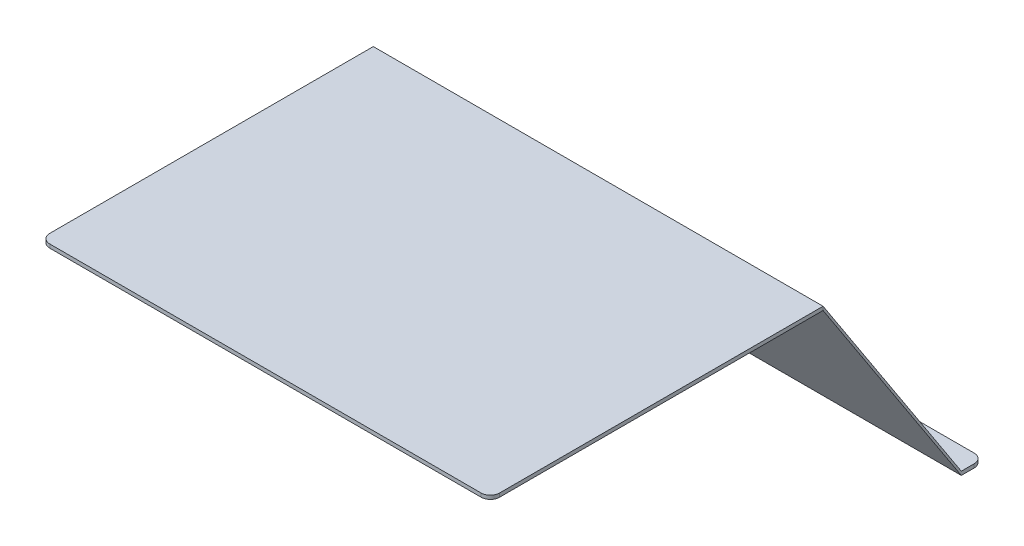
ISO-10303-21;
HEADER;
FILE_DESCRIPTION(('STEP AP214'),'2;1');
FILE_NAME('part.step','',(''),(''),'','','');
FILE_SCHEMA(('AUTOMOTIVE_DESIGN { 1 0 10303 214 1 1 1 1 }'));
ENDSEC;
DATA;
#1=APPLICATION_CONTEXT('core data for automotive mechanical design processes');
#2=APPLICATION_PROTOCOL_DEFINITION('international standard','automotive_design',2000,#1);
#3=PRODUCT_CONTEXT('',#1,'mechanical');
#4=PRODUCT('Part','Part','',(#3));
#5=PRODUCT_RELATED_PRODUCT_CATEGORY('part','',(#4));
#6=PRODUCT_DEFINITION_FORMATION('','',#4);
#7=PRODUCT_DEFINITION_CONTEXT('part definition',#1,'design');
#8=PRODUCT_DEFINITION('design','',#6,#7);
#9=PRODUCT_DEFINITION_SHAPE('','',#8);
#10=(LENGTH_UNIT() NAMED_UNIT(*) SI_UNIT(.MILLI.,.METRE.));
#11=(NAMED_UNIT(*) PLANE_ANGLE_UNIT() SI_UNIT($,.RADIAN.));
#12=(NAMED_UNIT(*) SI_UNIT($,.STERADIAN.) SOLID_ANGLE_UNIT());
#13=UNCERTAINTY_MEASURE_WITH_UNIT(LENGTH_MEASURE(1.E-05),#10,'distance_accuracy_value','');
#14=(GEOMETRIC_REPRESENTATION_CONTEXT(3) GLOBAL_UNCERTAINTY_ASSIGNED_CONTEXT((#13)) GLOBAL_UNIT_ASSIGNED_CONTEXT((#10,
#11,#12)) REPRESENTATION_CONTEXT('',''));
#15=CARTESIAN_POINT('',(0.,0.,0.));
#16=DIRECTION('',(0.,0.,1.));
#17=DIRECTION('',(1.,0.,0.));
#18=AXIS2_PLACEMENT_3D('',#15,#16,#17);
#19=CARTESIAN_POINT('',(0.,0.,-361.));
#20=DIRECTION('',(0.,0.,1.));
#21=DIRECTION('',(1.,0.,0.));
#22=AXIS2_PLACEMENT_3D('',#19,#20,#21);
#23=PLANE('',#22);
#24=DIRECTION('',(0.,-1.,0.));
#25=VECTOR('',#24,1.);
#26=CARTESIAN_POINT('',(488.,0.,-361.));
#27=LINE('',#26,#25);
#28=CARTESIAN_POINT('',(488.,4.,-361.));
#29=VERTEX_POINT('',#28);
#30=CARTESIAN_POINT('',(488.,0.,-361.));
#31=VERTEX_POINT('',#30);
#32=EDGE_CURVE('E172',#29,#31,#27,.T.);
#33=ORIENTED_EDGE('',*,*,#32,.F.);
#34=DIRECTION('',(1.,0.,0.));
#35=VECTOR('',#34,1.);
#36=CARTESIAN_POINT('',(0.,4.,-361.));
#37=LINE('',#36,#35);
#38=CARTESIAN_POINT('',(0.,4.,-361.));
#39=VERTEX_POINT('',#38);
#40=EDGE_CURVE('E123',#39,#29,#37,.T.);
#41=ORIENTED_EDGE('',*,*,#40,.F.);
#42=DIRECTION('',(0.,-1.,0.));
#43=VECTOR('',#42,1.);
#44=CARTESIAN_POINT('',(0.,0.,-361.));
#45=LINE('',#44,#43);
#46=CARTESIAN_POINT('',(0.,0.,-361.));
#47=VERTEX_POINT('',#46);
#48=EDGE_CURVE('E125',#39,#47,#45,.T.);
#49=ORIENTED_EDGE('',*,*,#48,.T.);
#50=DIRECTION('',(1.,0.,0.));
#51=VECTOR('',#50,1.);
#52=CARTESIAN_POINT('',(0.,0.,-361.));
#53=LINE('',#52,#51);
#54=EDGE_CURVE('E134',#47,#31,#53,.T.);
#55=ORIENTED_EDGE('',*,*,#54,.T.);
#56=EDGE_LOOP('',(#33,#41,#49,#55));
#57=FACE_BOUND('',#56,.T.);
#58=ADVANCED_FACE('F44',(#57),#23,.T.);
#59=CARTESIAN_POINT('',(0.,4.,-361.));
#60=DIRECTION('',(0.,0.546267780546922,-0.837610596838614));
#61=DIRECTION('',(0.,0.837610596838614,0.546267780546922));
#62=AXIS2_PLACEMENT_3D('',#59,#60,#61);
#63=PLANE('',#62);
#64=DIRECTION('',(0.,0.837610596838614,0.546267780546922));
#65=VECTOR('',#64,1.);
#66=CARTESIAN_POINT('',(488.,4.,-361.));
#67=LINE('',#66,#65);
#68=CARTESIAN_POINT('',(488.,-226.,-511.));
#69=VERTEX_POINT('',#68);
#70=EDGE_CURVE('E111',#69,#29,#67,.T.);
#71=ORIENTED_EDGE('',*,*,#70,.F.);
#72=DIRECTION('',(1.,0.,0.));
#73=VECTOR('',#72,1.);
#74=CARTESIAN_POINT('',(0.,-226.,-511.));
#75=LINE('',#74,#73);
#76=CARTESIAN_POINT('',(0.,-226.,-511.));
#77=VERTEX_POINT('',#76);
#78=EDGE_CURVE('E121',#77,#69,#75,.T.);
#79=ORIENTED_EDGE('',*,*,#78,.F.);
#80=DIRECTION('',(0.,0.837610596838614,0.546267780546922));
#81=VECTOR('',#80,1.);
#82=CARTESIAN_POINT('',(0.,4.,-361.));
#83=LINE('',#82,#81);
#84=EDGE_CURVE('E138',#77,#39,#83,.T.);
#85=ORIENTED_EDGE('',*,*,#84,.T.);
#86=ORIENTED_EDGE('',*,*,#40,.T.);
#87=EDGE_LOOP('',(#71,#79,#85,#86));
#88=FACE_BOUND('',#87,.T.);
#89=ADVANCED_FACE('F119',(#88),#63,.T.);
#90=CARTESIAN_POINT('',(0.,-230.,-511.));
#91=DIRECTION('',(0.,-0.546267780546922,0.837610596838614));
#92=DIRECTION('',(0.,-0.837610596838614,-0.546267780546922));
#93=AXIS2_PLACEMENT_3D('',#90,#91,#92);
#94=PLANE('',#93);
#95=DIRECTION('',(0.,-0.837610596838614,-0.546267780546922));
#96=VECTOR('',#95,1.);
#97=CARTESIAN_POINT('',(488.,-230.,-511.));
#98=LINE('',#97,#96);
#99=CARTESIAN_POINT('',(488.,-230.,-511.));
#100=VERTEX_POINT('',#99);
#101=EDGE_CURVE('E126',#31,#100,#98,.T.);
#102=ORIENTED_EDGE('',*,*,#101,.F.);
#103=ORIENTED_EDGE('',*,*,#54,.F.);
#104=DIRECTION('',(0.,-0.837610596838614,-0.546267780546922));
#105=VECTOR('',#104,1.);
#106=CARTESIAN_POINT('',(0.,-230.,-511.));
#107=LINE('',#106,#105);
#108=CARTESIAN_POINT('',(0.,-230.,-511.));
#109=VERTEX_POINT('',#108);
#110=EDGE_CURVE('E175',#47,#109,#107,.T.);
#111=ORIENTED_EDGE('',*,*,#110,.T.);
#112=DIRECTION('',(1.,0.,0.));
#113=VECTOR('',#112,1.);
#114=CARTESIAN_POINT('',(0.,-230.,-511.));
#115=LINE('',#114,#113);
#116=EDGE_CURVE('E129',#109,#100,#115,.T.);
#117=ORIENTED_EDGE('',*,*,#116,.T.);
#118=EDGE_LOOP('',(#102,#103,#111,#117));
#119=FACE_BOUND('',#118,.T.);
#120=ADVANCED_FACE('F184',(#119),#94,.T.);
#121=CARTESIAN_POINT('',(0.,0.,0.));
#122=DIRECTION('',(-1.,0.,0.));
#123=DIRECTION('',(0.,0.,1.));
#124=AXIS2_PLACEMENT_3D('',#121,#122,#123);
#125=PLANE('',#124);
#126=DIRECTION('',(0.,0.,1.));
#127=VECTOR('',#126,1.);
#128=CARTESIAN_POINT('',(0.,-226.,-535.));
#129=LINE('',#128,#127);
#130=CARTESIAN_POINT('',(0.,-226.,-525.));
#131=VERTEX_POINT('',#130);
#132=EDGE_CURVE('E114',#131,#77,#129,.T.);
#133=ORIENTED_EDGE('',*,*,#132,.F.);
#134=DIRECTION('',(0.,1.,0.));
#135=VECTOR('',#134,1.);
#136=CARTESIAN_POINT('',(0.,-230.,-525.));
#137=LINE('',#136,#135);
#138=CARTESIAN_POINT('',(0.,-230.,-525.));
#139=VERTEX_POINT('',#138);
#140=EDGE_CURVE('E12',#131,#139,#137,.F.);
#141=ORIENTED_EDGE('',*,*,#140,.T.);
#142=DIRECTION('',(0.,0.,1.));
#143=VECTOR('',#142,1.);
#144=CARTESIAN_POINT('',(0.,-230.,-535.));
#145=LINE('',#144,#143);
#146=EDGE_CURVE('E166',#139,#109,#145,.T.);
#147=ORIENTED_EDGE('',*,*,#146,.T.);
#148=ORIENTED_EDGE('',*,*,#110,.F.);
#149=ORIENTED_EDGE('',*,*,#48,.F.);
#150=ORIENTED_EDGE('',*,*,#84,.F.);
#151=EDGE_LOOP('',(#133,#141,#147,#148,#149,#150));
#152=FACE_BOUND('',#151,.T.);
#153=ADVANCED_FACE('F190',(#152),#125,.T.);
#154=CARTESIAN_POINT('',(488.,0.,0.));
#155=DIRECTION('',(-1.,0.,0.));
#156=DIRECTION('',(0.,0.,1.));
#157=AXIS2_PLACEMENT_3D('',#154,#155,#156);
#158=PLANE('',#157);
#159=DIRECTION('',(0.,0.,1.));
#160=VECTOR('',#159,1.);
#161=CARTESIAN_POINT('',(488.,-230.,-535.));
#162=LINE('',#161,#160);
#163=CARTESIAN_POINT('',(488.,-230.,-525.));
#164=VERTEX_POINT('',#163);
#165=EDGE_CURVE('E115',#164,#100,#162,.T.);
#166=ORIENTED_EDGE('',*,*,#165,.F.);
#167=DIRECTION('',(0.,-1.,0.));
#168=VECTOR('',#167,1.);
#169=CARTESIAN_POINT('',(488.,0.,-525.));
#170=LINE('',#169,#168);
#171=CARTESIAN_POINT('',(488.,-226.,-525.));
#172=VERTEX_POINT('',#171);
#173=EDGE_CURVE('E67',#164,#172,#170,.F.);
#174=ORIENTED_EDGE('',*,*,#173,.T.);
#175=DIRECTION('',(0.,0.,1.));
#176=VECTOR('',#175,1.);
#177=CARTESIAN_POINT('',(488.,-226.,-535.));
#178=LINE('',#177,#176);
#179=EDGE_CURVE('E107',#172,#69,#178,.T.);
#180=ORIENTED_EDGE('',*,*,#179,.T.);
#181=ORIENTED_EDGE('',*,*,#70,.T.);
#182=ORIENTED_EDGE('',*,*,#32,.T.);
#183=ORIENTED_EDGE('',*,*,#101,.T.);
#184=EDGE_LOOP('',(#166,#174,#180,#181,#182,#183));
#185=FACE_BOUND('',#184,.T.);
#186=ADVANCED_FACE('F109',(#185),#158,.F.);
#187=CARTESIAN_POINT('',(0.,-226.,-535.));
#188=DIRECTION('',(0.,-1.,0.));
#189=DIRECTION('',(0.,0.,-1.));
#190=AXIS2_PLACEMENT_3D('',#187,#188,#189);
#191=PLANE('',#190);
#192=ORIENTED_EDGE('',*,*,#179,.F.);
#193=CARTESIAN_POINT('',(478.,-226.,-525.));
#194=DIRECTION('',(0.,-1.,0.));
#195=DIRECTION('',(0.,0.,-1.));
#196=AXIS2_PLACEMENT_3D('',#193,#194,#195);
#197=CIRCLE('',#196,10.);
#198=CARTESIAN_POINT('',(478.,-226.,-535.));
#199=VERTEX_POINT('',#198);
#200=EDGE_CURVE('E52',#172,#199,#197,.F.);
#201=ORIENTED_EDGE('',*,*,#200,.T.);
#202=DIRECTION('',(1.,0.,0.));
#203=VECTOR('',#202,1.);
#204=CARTESIAN_POINT('',(0.,-226.,-535.));
#205=LINE('',#204,#203);
#206=CARTESIAN_POINT('',(10.,-226.,-535.));
#207=VERTEX_POINT('',#206);
#208=EDGE_CURVE('E150',#207,#199,#205,.T.);
#209=ORIENTED_EDGE('',*,*,#208,.F.);
#210=CARTESIAN_POINT('',(10.,-226.,-525.));
#211=DIRECTION('',(0.,-1.,0.));
#212=DIRECTION('',(0.,0.,-1.));
#213=AXIS2_PLACEMENT_3D('',#210,#211,#212);
#214=CIRCLE('',#213,10.);
#215=EDGE_CURVE('E59',#207,#131,#214,.F.);
#216=ORIENTED_EDGE('',*,*,#215,.T.);
#217=ORIENTED_EDGE('',*,*,#132,.T.);
#218=ORIENTED_EDGE('',*,*,#78,.T.);
#219=EDGE_LOOP('',(#192,#201,#209,#216,#217,#218));
#220=FACE_BOUND('',#219,.T.);
#221=ADVANCED_FACE('F128',(#220),#191,.F.);
#222=CARTESIAN_POINT('',(0.,-230.,-535.));
#223=DIRECTION('',(0.,1.,0.));
#224=DIRECTION('',(0.,0.,1.));
#225=AXIS2_PLACEMENT_3D('',#222,#223,#224);
#226=PLANE('',#225);
#227=DIRECTION('',(-1.,0.,0.));
#228=VECTOR('',#227,1.);
#229=CARTESIAN_POINT('',(0.,-230.,-535.));
#230=LINE('',#229,#228);
#231=CARTESIAN_POINT('',(478.,-230.,-535.));
#232=VERTEX_POINT('',#231);
#233=CARTESIAN_POINT('',(10.,-230.,-535.));
#234=VERTEX_POINT('',#233);
#235=EDGE_CURVE('E158',#232,#234,#230,.T.);
#236=ORIENTED_EDGE('',*,*,#235,.F.);
#237=CARTESIAN_POINT('',(478.,-230.,-525.));
#238=DIRECTION('',(0.,1.,0.));
#239=DIRECTION('',(0.,0.,1.));
#240=AXIS2_PLACEMENT_3D('',#237,#238,#239);
#241=CIRCLE('',#240,10.);
#242=EDGE_CURVE('E146',#232,#164,#241,.F.);
#243=ORIENTED_EDGE('',*,*,#242,.T.);
#244=ORIENTED_EDGE('',*,*,#165,.T.);
#245=ORIENTED_EDGE('',*,*,#116,.F.);
#246=ORIENTED_EDGE('',*,*,#146,.F.);
#247=CARTESIAN_POINT('',(10.,-230.,-525.));
#248=DIRECTION('',(0.,1.,0.));
#249=DIRECTION('',(0.,0.,1.));
#250=AXIS2_PLACEMENT_3D('',#247,#248,#249);
#251=CIRCLE('',#250,10.);
#252=EDGE_CURVE('E144',#139,#234,#251,.F.);
#253=ORIENTED_EDGE('',*,*,#252,.T.);
#254=EDGE_LOOP('',(#236,#243,#244,#245,#246,#253));
#255=FACE_BOUND('',#254,.T.);
#256=ADVANCED_FACE('F162',(#255),#226,.F.);
#257=CARTESIAN_POINT('',(0.,0.,-535.));
#258=DIRECTION('',(0.,0.,1.));
#259=DIRECTION('',(1.,0.,0.));
#260=AXIS2_PLACEMENT_3D('',#257,#258,#259);
#261=PLANE('',#260);
#262=ORIENTED_EDGE('',*,*,#208,.T.);
#263=DIRECTION('',(0.,-1.,0.));
#264=VECTOR('',#263,1.);
#265=CARTESIAN_POINT('',(478.,0.,-535.));
#266=LINE('',#265,#264);
#267=EDGE_CURVE('E141',#199,#232,#266,.T.);
#268=ORIENTED_EDGE('',*,*,#267,.T.);
#269=ORIENTED_EDGE('',*,*,#235,.T.);
#270=DIRECTION('',(0.,1.,0.));
#271=VECTOR('',#270,1.);
#272=CARTESIAN_POINT('',(10.,-226.,-535.));
#273=LINE('',#272,#271);
#274=EDGE_CURVE('E131',#234,#207,#273,.T.);
#275=ORIENTED_EDGE('',*,*,#274,.T.);
#276=EDGE_LOOP('',(#262,#268,#269,#275));
#277=FACE_BOUND('',#276,.T.);
#278=ADVANCED_FACE('F154',(#277),#261,.F.);
#279=CARTESIAN_POINT('',(478.,0.,-525.));
#280=DIRECTION('',(0.,-1.,0.));
#281=DIRECTION('',(0.,0.,-1.));
#282=AXIS2_PLACEMENT_3D('',#279,#280,#281);
#283=CYLINDRICAL_SURFACE('',#282,10.);
#284=ORIENTED_EDGE('',*,*,#200,.F.);
#285=ORIENTED_EDGE('',*,*,#173,.F.);
#286=ORIENTED_EDGE('',*,*,#242,.F.);
#287=ORIENTED_EDGE('',*,*,#267,.F.);
#288=EDGE_LOOP('',(#284,#285,#286,#287));
#289=FACE_BOUND('',#288,.T.);
#290=ADVANCED_FACE('F160',(#289),#283,.T.);
#291=CARTESIAN_POINT('',(10.,0.,-525.));
#292=DIRECTION('',(0.,-1.,0.));
#293=DIRECTION('',(0.,0.,-1.));
#294=AXIS2_PLACEMENT_3D('',#291,#292,#293);
#295=CYLINDRICAL_SURFACE('',#294,10.);
#296=ORIENTED_EDGE('',*,*,#252,.F.);
#297=ORIENTED_EDGE('',*,*,#140,.F.);
#298=ORIENTED_EDGE('',*,*,#215,.F.);
#299=ORIENTED_EDGE('',*,*,#274,.F.);
#300=EDGE_LOOP('',(#296,#297,#298,#299));
#301=FACE_BOUND('',#300,.T.);
#302=ADVANCED_FACE('F46',(#301),#295,.T.);
#303=CLOSED_SHELL('',(#58,#89,#120,#153,#186,#221,#256,#278,#290,#302));
#304=MANIFOLD_SOLID_BREP('B2',#303);
#305=CARTESIAN_POINT('',(488.,0.,0.));
#306=DIRECTION('',(0.,0.,-1.));
#307=DIRECTION('',(-1.,0.,0.));
#308=AXIS2_PLACEMENT_3D('',#305,#306,#307);
#309=PLANE('',#308);
#310=DIRECTION('',(-1.,0.,0.));
#311=VECTOR('',#310,1.);
#312=CARTESIAN_POINT('',(488.,4.,0.));
#313=LINE('',#312,#311);
#314=CARTESIAN_POINT('',(478.,4.,0.));
#315=VERTEX_POINT('',#314);
#316=CARTESIAN_POINT('',(10.0000000000001,4.,0.));
#317=VERTEX_POINT('',#316);
#318=EDGE_CURVE('E357',#315,#317,#313,.T.);
#319=ORIENTED_EDGE('',*,*,#318,.T.);
#320=DIRECTION('',(0.,-1.,0.));
#321=VECTOR('',#320,1.);
#322=CARTESIAN_POINT('',(10.,0.,0.));
#323=LINE('',#322,#321);
#324=CARTESIAN_POINT('',(10.0000000000001,0.,0.));
#325=VERTEX_POINT('',#324);
#326=EDGE_CURVE('E370',#317,#325,#323,.T.);
#327=ORIENTED_EDGE('',*,*,#326,.T.);
#328=DIRECTION('',(-1.,0.,0.));
#329=VECTOR('',#328,1.);
#330=CARTESIAN_POINT('',(488.,0.,0.));
#331=LINE('',#330,#329);
#332=CARTESIAN_POINT('',(478.,0.,0.));
#333=VERTEX_POINT('',#332);
#334=EDGE_CURVE('E350',#333,#325,#331,.T.);
#335=ORIENTED_EDGE('',*,*,#334,.F.);
#336=DIRECTION('',(0.,-1.,0.));
#337=VECTOR('',#336,1.);
#338=CARTESIAN_POINT('',(478.,0.,0.));
#339=LINE('',#338,#337);
#340=EDGE_CURVE('E368',#333,#315,#339,.F.);
#341=ORIENTED_EDGE('',*,*,#340,.T.);
#342=EDGE_LOOP('',(#319,#327,#335,#341));
#343=FACE_BOUND('',#342,.T.);
#344=ADVANCED_FACE('F277',(#343),#309,.F.);
#345=CARTESIAN_POINT('',(488.,0.,0.));
#346=DIRECTION('',(0.,1.,0.));
#347=DIRECTION('',(0.,0.,1.));
#348=AXIS2_PLACEMENT_3D('',#345,#346,#347);
#349=PLANE('',#348);
#350=ORIENTED_EDGE('',*,*,#334,.T.);
#351=CARTESIAN_POINT('',(10.,0.,-10.));
#352=DIRECTION('',(0.,1.,0.));
#353=DIRECTION('',(0.,0.,1.));
#354=AXIS2_PLACEMENT_3D('',#351,#352,#353);
#355=CIRCLE('',#354,10.);
#356=CARTESIAN_POINT('',(0.,0.,-10.));
#357=VERTEX_POINT('',#356);
#358=EDGE_CURVE('E375',#325,#357,#355,.F.);
#359=ORIENTED_EDGE('',*,*,#358,.T.);
#360=DIRECTION('',(0.,0.,-1.));
#361=VECTOR('',#360,1.);
#362=CARTESIAN_POINT('',(0.,0.,0.));
#363=LINE('',#362,#361);
#364=CARTESIAN_POINT('',(0.,0.,-361.));
#365=VERTEX_POINT('',#364);
#366=EDGE_CURVE('E347',#357,#365,#363,.T.);
#367=ORIENTED_EDGE('',*,*,#366,.T.);
#368=DIRECTION('',(-1.,0.,0.));
#369=VECTOR('',#368,1.);
#370=CARTESIAN_POINT('',(488.,0.,-361.));
#371=LINE('',#370,#369);
#372=CARTESIAN_POINT('',(488.,0.,-361.));
#373=VERTEX_POINT('',#372);
#374=EDGE_CURVE('E344',#373,#365,#371,.T.);
#375=ORIENTED_EDGE('',*,*,#374,.F.);
#376=DIRECTION('',(0.,0.,-1.));
#377=VECTOR('',#376,1.);
#378=CARTESIAN_POINT('',(488.,0.,0.));
#379=LINE('',#378,#377);
#380=CARTESIAN_POINT('',(488.,0.,-10.));
#381=VERTEX_POINT('',#380);
#382=EDGE_CURVE('E333',#381,#373,#379,.T.);
#383=ORIENTED_EDGE('',*,*,#382,.F.);
#384=CARTESIAN_POINT('',(478.,0.,-10.));
#385=DIRECTION('',(0.,1.,0.));
#386=DIRECTION('',(0.,0.,1.));
#387=AXIS2_PLACEMENT_3D('',#384,#385,#386);
#388=CIRCLE('',#387,10.);
#389=EDGE_CURVE('E373',#381,#333,#388,.F.);
#390=ORIENTED_EDGE('',*,*,#389,.T.);
#391=EDGE_LOOP('',(#350,#359,#367,#375,#383,#390));
#392=FACE_BOUND('',#391,.T.);
#393=ADVANCED_FACE('F346',(#392),#349,.F.);
#394=CARTESIAN_POINT('',(488.,0.,-361.));
#395=DIRECTION('',(0.,0.,1.));
#396=DIRECTION('',(1.,0.,0.));
#397=AXIS2_PLACEMENT_3D('',#394,#395,#396);
#398=PLANE('',#397);
#399=DIRECTION('',(0.,1.,0.));
#400=VECTOR('',#399,1.);
#401=CARTESIAN_POINT('',(0.,0.,-361.));
#402=LINE('',#401,#400);
#403=CARTESIAN_POINT('',(0.,4.,-361.));
#404=VERTEX_POINT('',#403);
#405=EDGE_CURVE('E361',#365,#404,#402,.T.);
#406=ORIENTED_EDGE('',*,*,#405,.T.);
#407=DIRECTION('',(-1.,0.,0.));
#408=VECTOR('',#407,1.);
#409=CARTESIAN_POINT('',(488.,4.,-361.));
#410=LINE('',#409,#408);
#411=CARTESIAN_POINT('',(488.,4.,-361.));
#412=VERTEX_POINT('',#411);
#413=EDGE_CURVE('E351',#412,#404,#410,.T.);
#414=ORIENTED_EDGE('',*,*,#413,.F.);
#415=DIRECTION('',(0.,1.,0.));
#416=VECTOR('',#415,1.);
#417=CARTESIAN_POINT('',(488.,0.,-361.));
#418=LINE('',#417,#416);
#419=EDGE_CURVE('E337',#373,#412,#418,.T.);
#420=ORIENTED_EDGE('',*,*,#419,.F.);
#421=ORIENTED_EDGE('',*,*,#374,.T.);
#422=EDGE_LOOP('',(#406,#414,#420,#421));
#423=FACE_BOUND('',#422,.T.);
#424=ADVANCED_FACE('F353',(#423),#398,.F.);
#425=CARTESIAN_POINT('',(488.,4.,0.));
#426=DIRECTION('',(0.,-1.,0.));
#427=DIRECTION('',(0.,0.,-1.));
#428=AXIS2_PLACEMENT_3D('',#425,#426,#427);
#429=PLANE('',#428);
#430=DIRECTION('',(0.,0.,1.));
#431=VECTOR('',#430,1.);
#432=CARTESIAN_POINT('',(0.,4.,0.));
#433=LINE('',#432,#431);
#434=CARTESIAN_POINT('',(0.,4.,-10.));
#435=VERTEX_POINT('',#434);
#436=EDGE_CURVE('E341',#404,#435,#433,.T.);
#437=ORIENTED_EDGE('',*,*,#436,.T.);
#438=CARTESIAN_POINT('',(10.,4.,-10.));
#439=DIRECTION('',(0.,-1.,0.));
#440=DIRECTION('',(0.,0.,-1.));
#441=AXIS2_PLACEMENT_3D('',#438,#439,#440);
#442=CIRCLE('',#441,10.);
#443=EDGE_CURVE('E285',#435,#317,#442,.F.);
#444=ORIENTED_EDGE('',*,*,#443,.T.);
#445=ORIENTED_EDGE('',*,*,#318,.F.);
#446=CARTESIAN_POINT('',(478.,4.,-10.));
#447=DIRECTION('',(0.,-1.,0.));
#448=DIRECTION('',(0.,0.,-1.));
#449=AXIS2_PLACEMENT_3D('',#446,#447,#448);
#450=CIRCLE('',#449,10.);
#451=CARTESIAN_POINT('',(488.,4.,-10.));
#452=VERTEX_POINT('',#451);
#453=EDGE_CURVE('E292',#315,#452,#450,.F.);
#454=ORIENTED_EDGE('',*,*,#453,.T.);
#455=DIRECTION('',(0.,0.,1.));
#456=VECTOR('',#455,1.);
#457=CARTESIAN_POINT('',(488.,4.,0.));
#458=LINE('',#457,#456);
#459=EDGE_CURVE('E355',#412,#452,#458,.T.);
#460=ORIENTED_EDGE('',*,*,#459,.F.);
#461=ORIENTED_EDGE('',*,*,#413,.T.);
#462=EDGE_LOOP('',(#437,#444,#445,#454,#460,#461));
#463=FACE_BOUND('',#462,.T.);
#464=ADVANCED_FACE('F379',(#463),#429,.F.);
#465=CARTESIAN_POINT('',(488.,0.,0.));
#466=DIRECTION('',(-1.,0.,0.));
#467=DIRECTION('',(0.,0.,1.));
#468=AXIS2_PLACEMENT_3D('',#465,#466,#467);
#469=PLANE('',#468);
#470=ORIENTED_EDGE('',*,*,#459,.T.);
#471=DIRECTION('',(0.,-1.,0.));
#472=VECTOR('',#471,1.);
#473=CARTESIAN_POINT('',(488.,0.,-10.));
#474=LINE('',#473,#472);
#475=EDGE_CURVE('E42',#452,#381,#474,.T.);
#476=ORIENTED_EDGE('',*,*,#475,.T.);
#477=ORIENTED_EDGE('',*,*,#382,.T.);
#478=ORIENTED_EDGE('',*,*,#419,.T.);
#479=EDGE_LOOP('',(#470,#476,#477,#478));
#480=FACE_BOUND('',#479,.T.);
#481=ADVANCED_FACE('F335',(#480),#469,.F.);
#482=CARTESIAN_POINT('',(0.,0.,0.));
#483=DIRECTION('',(-1.,0.,0.));
#484=DIRECTION('',(0.,0.,1.));
#485=AXIS2_PLACEMENT_3D('',#482,#483,#484);
#486=PLANE('',#485);
#487=ORIENTED_EDGE('',*,*,#366,.F.);
#488=DIRECTION('',(0.,-1.,0.));
#489=VECTOR('',#488,1.);
#490=CARTESIAN_POINT('',(0.,4.,-10.));
#491=LINE('',#490,#489);
#492=EDGE_CURVE('E300',#357,#435,#491,.F.);
#493=ORIENTED_EDGE('',*,*,#492,.T.);
#494=ORIENTED_EDGE('',*,*,#436,.F.);
#495=ORIENTED_EDGE('',*,*,#405,.F.);
#496=EDGE_LOOP('',(#487,#493,#494,#495));
#497=FACE_BOUND('',#496,.T.);
#498=ADVANCED_FACE('F386',(#497),#486,.T.);
#499=CARTESIAN_POINT('',(10.,0.,-10.));
#500=DIRECTION('',(0.,1.,0.));
#501=DIRECTION('',(0.,0.,1.));
#502=AXIS2_PLACEMENT_3D('',#499,#500,#501);
#503=CYLINDRICAL_SURFACE('',#502,10.);
#504=ORIENTED_EDGE('',*,*,#443,.F.);
#505=ORIENTED_EDGE('',*,*,#492,.F.);
#506=ORIENTED_EDGE('',*,*,#358,.F.);
#507=ORIENTED_EDGE('',*,*,#326,.F.);
#508=EDGE_LOOP('',(#504,#505,#506,#507));
#509=FACE_BOUND('',#508,.T.);
#510=ADVANCED_FACE('F385',(#509),#503,.T.);
#511=CARTESIAN_POINT('',(478.,0.,-10.));
#512=DIRECTION('',(0.,-1.,0.));
#513=DIRECTION('',(0.,0.,-1.));
#514=AXIS2_PLACEMENT_3D('',#511,#512,#513);
#515=CYLINDRICAL_SURFACE('',#514,10.);
#516=ORIENTED_EDGE('',*,*,#453,.F.);
#517=ORIENTED_EDGE('',*,*,#340,.F.);
#518=ORIENTED_EDGE('',*,*,#389,.F.);
#519=ORIENTED_EDGE('',*,*,#475,.F.);
#520=EDGE_LOOP('',(#516,#517,#518,#519));
#521=FACE_BOUND('',#520,.T.);
#522=ADVANCED_FACE('F279',(#521),#515,.T.);
#523=CLOSED_SHELL('',(#344,#393,#424,#464,#481,#498,#510,#522));
#524=MANIFOLD_SOLID_BREP('B6',#523);
#525=ADVANCED_BREP_SHAPE_REPRESENTATION('',(#18,#304,#524),#14);
#526=SHAPE_DEFINITION_REPRESENTATION(#9,#525);
ENDSEC;
END-ISO-10303-21;
